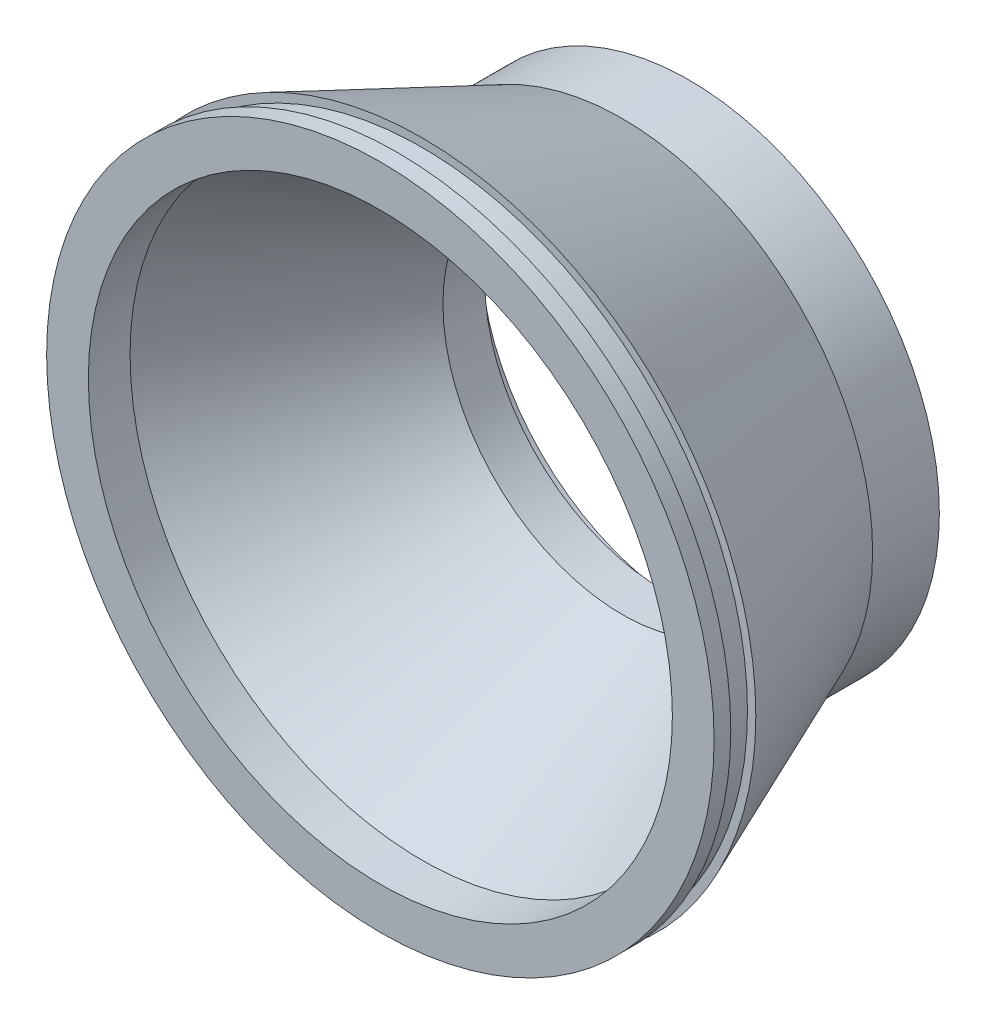
ISO-10303-21;
HEADER;
FILE_DESCRIPTION(('STEP AP214'),'2;1');
FILE_NAME('part.step','',(''),(''),'','','');
FILE_SCHEMA(('AUTOMOTIVE_DESIGN { 1 0 10303 214 1 1 1 1 }'));
ENDSEC;
DATA;
#1=APPLICATION_CONTEXT('core data for automotive mechanical design processes');
#2=APPLICATION_PROTOCOL_DEFINITION('international standard','automotive_design',2000,#1);
#3=PRODUCT_CONTEXT('',#1,'mechanical');
#4=PRODUCT('Part','Part','',(#3));
#5=PRODUCT_RELATED_PRODUCT_CATEGORY('part','',(#4));
#6=PRODUCT_DEFINITION_FORMATION('','',#4);
#7=PRODUCT_DEFINITION_CONTEXT('part definition',#1,'design');
#8=PRODUCT_DEFINITION('design','',#6,#7);
#9=PRODUCT_DEFINITION_SHAPE('','',#8);
#10=(LENGTH_UNIT() NAMED_UNIT(*) SI_UNIT(.MILLI.,.METRE.));
#11=(NAMED_UNIT(*) PLANE_ANGLE_UNIT() SI_UNIT($,.RADIAN.));
#12=(NAMED_UNIT(*) SI_UNIT($,.STERADIAN.) SOLID_ANGLE_UNIT());
#13=UNCERTAINTY_MEASURE_WITH_UNIT(LENGTH_MEASURE(1.E-05),#10,'distance_accuracy_value','');
#14=(GEOMETRIC_REPRESENTATION_CONTEXT(3) GLOBAL_UNCERTAINTY_ASSIGNED_CONTEXT((#13)) GLOBAL_UNIT_ASSIGNED_CONTEXT((#10,
#11,#12)) REPRESENTATION_CONTEXT('',''));
#15=CARTESIAN_POINT('',(0.,0.,0.));
#16=DIRECTION('',(0.,0.,1.));
#17=DIRECTION('',(1.,0.,0.));
#18=AXIS2_PLACEMENT_3D('',#15,#16,#17);
#19=CARTESIAN_POINT('',(0.,0.,3.));
#20=DIRECTION('',(0.,0.,-1.));
#21=DIRECTION('',(-1.,0.,0.));
#22=AXIS2_PLACEMENT_3D('',#19,#20,#21);
#23=CYLINDRICAL_SURFACE('',#22,25.);
#24=DIRECTION('',(0.,0.,-1.));
#25=VECTOR('',#24,1.);
#26=CARTESIAN_POINT('',(-21.6639868915005,-12.4768454332372,3.));
#27=LINE('',#26,#25);
#28=CARTESIAN_POINT('',(-21.6639868915005,-12.4768454332372,3.));
#29=VERTEX_POINT('',#28);
#30=CARTESIAN_POINT('',(-21.6639868915005,-12.4768454332372,0.5));
#31=VERTEX_POINT('',#30);
#32=EDGE_CURVE('E172',#29,#31,#27,.T.);
#33=ORIENTED_EDGE('',*,*,#32,.F.);
#34=CARTESIAN_POINT('',(0.,0.,3.));
#35=DIRECTION('',(0.,0.,-1.));
#36=DIRECTION('',(-1.,0.,0.));
#37=AXIS2_PLACEMENT_3D('',#34,#35,#36);
#38=CIRCLE('',#37,25.);
#39=CARTESIAN_POINT('',(-2.99459513123227,-24.82,3.));
#40=VERTEX_POINT('',#39);
#41=EDGE_CURVE('E183',#40,#29,#38,.T.);
#42=ORIENTED_EDGE('',*,*,#41,.F.);
#43=DIRECTION('',(0.,0.,-1.));
#44=VECTOR('',#43,1.);
#45=CARTESIAN_POINT('',(-2.99459513123227,-24.82,3.));
#46=LINE('',#45,#44);
#47=CARTESIAN_POINT('',(-2.99459513123227,-24.82,0.));
#48=VERTEX_POINT('',#47);
#49=EDGE_CURVE('E252',#40,#48,#46,.T.);
#50=ORIENTED_EDGE('',*,*,#49,.T.);
#51=CARTESIAN_POINT('',(0.,0.,0.));
#52=DIRECTION('',(0.,0.,-1.));
#53=DIRECTION('',(-1.,0.,0.));
#54=AXIS2_PLACEMENT_3D('',#51,#52,#53);
#55=CIRCLE('',#54,25.);
#56=CARTESIAN_POINT('',(-24.82,-2.99459513123227,0.));
#57=VERTEX_POINT('',#56);
#58=EDGE_CURVE('E203',#48,#57,#55,.T.);
#59=ORIENTED_EDGE('',*,*,#58,.T.);
#60=DIRECTION('',(0.,0.,-1.));
#61=VECTOR('',#60,1.);
#62=CARTESIAN_POINT('',(-24.82,-2.99459513123227,3.));
#63=LINE('',#62,#61);
#64=CARTESIAN_POINT('',(-24.82,-2.99459513123227,0.5));
#65=VERTEX_POINT('',#64);
#66=EDGE_CURVE('E249',#65,#57,#63,.T.);
#67=ORIENTED_EDGE('',*,*,#66,.F.);
#68=CARTESIAN_POINT('',(0.,0.,0.5));
#69=DIRECTION('',(0.,0.,1.));
#70=DIRECTION('',(-1.,0.,0.));
#71=AXIS2_PLACEMENT_3D('',#68,#69,#70);
#72=CIRCLE('',#71,25.);
#73=EDGE_CURVE('E185',#65,#31,#72,.T.);
#74=ORIENTED_EDGE('',*,*,#73,.T.);
#75=EDGE_LOOP('',(#33,#42,#50,#59,#67,#74));
#76=FACE_BOUND('',#75,.T.);
#77=ADVANCED_FACE('F34',(#76),#23,.F.);
#78=CARTESIAN_POINT('',(-25.,0.,3.));
#79=DIRECTION('',(0.,0.,-1.));
#80=DIRECTION('',(-1.,0.,0.));
#81=AXIS2_PLACEMENT_3D('',#78,#79,#80);
#82=CYLINDRICAL_SURFACE('',#81,3.);
#83=CARTESIAN_POINT('',(-25.,0.,0.5));
#84=DIRECTION('',(0.,0.,1.));
#85=DIRECTION('',(1.,0.,0.));
#86=AXIS2_PLACEMENT_3D('',#83,#84,#85);
#87=CIRCLE('',#86,3.);
#88=CARTESIAN_POINT('',(-28.,0.,0.5));
#89=VERTEX_POINT('',#88);
#90=EDGE_CURVE('E11',#65,#89,#87,.F.);
#91=ORIENTED_EDGE('',*,*,#90,.F.);
#92=ORIENTED_EDGE('',*,*,#66,.T.);
#93=CARTESIAN_POINT('',(-25.,0.,0.));
#94=DIRECTION('',(0.,0.,-1.));
#95=DIRECTION('',(-1.,0.,0.));
#96=AXIS2_PLACEMENT_3D('',#93,#94,#95);
#97=CIRCLE('',#96,3.);
#98=CARTESIAN_POINT('',(-24.82,2.99459513123227,0.));
#99=VERTEX_POINT('',#98);
#100=EDGE_CURVE('E250',#57,#99,#97,.T.);
#101=ORIENTED_EDGE('',*,*,#100,.T.);
#102=DIRECTION('',(0.,0.,-1.));
#103=VECTOR('',#102,1.);
#104=CARTESIAN_POINT('',(-24.82,2.99459513123227,3.));
#105=LINE('',#104,#103);
#106=CARTESIAN_POINT('',(-24.82,2.99459513123227,3.));
#107=VERTEX_POINT('',#106);
#108=EDGE_CURVE('E244',#107,#99,#105,.T.);
#109=ORIENTED_EDGE('',*,*,#108,.F.);
#110=CARTESIAN_POINT('',(-25.,0.,3.));
#111=DIRECTION('',(0.,0.,-1.));
#112=DIRECTION('',(-1.,0.,0.));
#113=AXIS2_PLACEMENT_3D('',#110,#111,#112);
#114=CIRCLE('',#113,3.);
#115=CARTESIAN_POINT('',(-28.,0.,3.));
#116=VERTEX_POINT('',#115);
#117=EDGE_CURVE('E247',#116,#107,#114,.T.);
#118=ORIENTED_EDGE('',*,*,#117,.F.);
#119=DIRECTION('',(0.,0.,1.));
#120=VECTOR('',#119,1.);
#121=CARTESIAN_POINT('',(-28.,0.,3.));
#122=LINE('',#121,#120);
#123=EDGE_CURVE('E186',#89,#116,#122,.T.);
#124=ORIENTED_EDGE('',*,*,#123,.F.);
#125=EDGE_LOOP('',(#91,#92,#101,#109,#118,#124));
#126=FACE_BOUND('',#125,.T.);
#127=ADVANCED_FACE('F345',(#126),#82,.F.);
#128=CARTESIAN_POINT('',(0.,-25.,3.));
#129=DIRECTION('',(0.,0.,-1.));
#130=DIRECTION('',(-1.,0.,0.));
#131=AXIS2_PLACEMENT_3D('',#128,#129,#130);
#132=CYLINDRICAL_SURFACE('',#131,3.);
#133=DIRECTION('',(0.,0.,-1.));
#134=VECTOR('',#133,1.);
#135=CARTESIAN_POINT('',(0.,-28.,3.));
#136=LINE('',#135,#134);
#137=CARTESIAN_POINT('',(0.,-28.,3.));
#138=VERTEX_POINT('',#137);
#139=CARTESIAN_POINT('',(0.,-28.,0.5));
#140=VERTEX_POINT('',#139);
#141=EDGE_CURVE('E177',#138,#140,#136,.T.);
#142=ORIENTED_EDGE('',*,*,#141,.T.);
#143=CARTESIAN_POINT('',(0.,-25.,0.5));
#144=DIRECTION('',(0.,0.,-1.));
#145=DIRECTION('',(-1.,0.,0.));
#146=AXIS2_PLACEMENT_3D('',#143,#144,#145);
#147=CIRCLE('',#146,3.);
#148=CARTESIAN_POINT('',(2.99459513123227,-24.82,0.5));
#149=VERTEX_POINT('',#148);
#150=EDGE_CURVE('E42',#140,#149,#147,.F.);
#151=ORIENTED_EDGE('',*,*,#150,.T.);
#152=DIRECTION('',(0.,0.,-1.));
#153=VECTOR('',#152,1.);
#154=CARTESIAN_POINT('',(2.99459513123227,-24.82,3.));
#155=LINE('',#154,#153);
#156=CARTESIAN_POINT('',(2.99459513123227,-24.82,0.));
#157=VERTEX_POINT('',#156);
#158=EDGE_CURVE('E257',#149,#157,#155,.T.);
#159=ORIENTED_EDGE('',*,*,#158,.T.);
#160=CARTESIAN_POINT('',(0.,-25.,0.));
#161=DIRECTION('',(0.,0.,-1.));
#162=DIRECTION('',(-1.,0.,0.));
#163=AXIS2_PLACEMENT_3D('',#160,#161,#162);
#164=CIRCLE('',#163,3.);
#165=EDGE_CURVE('E258',#157,#48,#164,.T.);
#166=ORIENTED_EDGE('',*,*,#165,.T.);
#167=ORIENTED_EDGE('',*,*,#49,.F.);
#168=CARTESIAN_POINT('',(0.,-25.,3.));
#169=DIRECTION('',(0.,0.,-1.));
#170=DIRECTION('',(-1.,0.,0.));
#171=AXIS2_PLACEMENT_3D('',#168,#169,#170);
#172=CIRCLE('',#171,3.);
#173=EDGE_CURVE('E192',#138,#40,#172,.T.);
#174=ORIENTED_EDGE('',*,*,#173,.F.);
#175=EDGE_LOOP('',(#142,#151,#159,#166,#167,#174));
#176=FACE_BOUND('',#175,.T.);
#177=ADVANCED_FACE('F299',(#176),#132,.F.);
#178=CARTESIAN_POINT('',(0.,25.,3.));
#179=DIRECTION('',(0.,0.,-1.));
#180=DIRECTION('',(-1.,0.,0.));
#181=AXIS2_PLACEMENT_3D('',#178,#179,#180);
#182=CYLINDRICAL_SURFACE('',#181,3.);
#183=DIRECTION('',(0.,0.,-1.));
#184=VECTOR('',#183,1.);
#185=CARTESIAN_POINT('',(0.,28.,3.));
#186=LINE('',#185,#184);
#187=CARTESIAN_POINT('',(0.,28.,3.));
#188=VERTEX_POINT('',#187);
#189=CARTESIAN_POINT('',(0.,28.,0.5));
#190=VERTEX_POINT('',#189);
#191=EDGE_CURVE('E382',#188,#190,#186,.T.);
#192=ORIENTED_EDGE('',*,*,#191,.T.);
#193=CARTESIAN_POINT('',(0.,25.,0.5));
#194=DIRECTION('',(0.,0.,-1.));
#195=DIRECTION('',(-1.,0.,0.));
#196=AXIS2_PLACEMENT_3D('',#193,#194,#195);
#197=CIRCLE('',#196,3.);
#198=CARTESIAN_POINT('',(-2.99459513123227,24.82,0.5));
#199=VERTEX_POINT('',#198);
#200=EDGE_CURVE('E294',#190,#199,#197,.F.);
#201=ORIENTED_EDGE('',*,*,#200,.T.);
#202=DIRECTION('',(0.,0.,-1.));
#203=VECTOR('',#202,1.);
#204=CARTESIAN_POINT('',(-2.99459513123227,24.82,3.));
#205=LINE('',#204,#203);
#206=CARTESIAN_POINT('',(-2.99459513123227,24.82,0.));
#207=VERTEX_POINT('',#206);
#208=EDGE_CURVE('E241',#199,#207,#205,.T.);
#209=ORIENTED_EDGE('',*,*,#208,.T.);
#210=CARTESIAN_POINT('',(0.,25.,0.));
#211=DIRECTION('',(0.,0.,-1.));
#212=DIRECTION('',(-1.,0.,0.));
#213=AXIS2_PLACEMENT_3D('',#210,#211,#212);
#214=CIRCLE('',#213,3.);
#215=CARTESIAN_POINT('',(2.99459513123227,24.82,0.));
#216=VERTEX_POINT('',#215);
#217=EDGE_CURVE('E242',#207,#216,#214,.T.);
#218=ORIENTED_EDGE('',*,*,#217,.T.);
#219=DIRECTION('',(0.,0.,-1.));
#220=VECTOR('',#219,1.);
#221=CARTESIAN_POINT('',(2.99459513123227,24.82,3.));
#222=LINE('',#221,#220);
#223=CARTESIAN_POINT('',(2.99459513123227,24.82,3.));
#224=VERTEX_POINT('',#223);
#225=EDGE_CURVE('E224',#224,#216,#222,.T.);
#226=ORIENTED_EDGE('',*,*,#225,.F.);
#227=CARTESIAN_POINT('',(0.,25.,3.));
#228=DIRECTION('',(0.,0.,-1.));
#229=DIRECTION('',(-1.,0.,0.));
#230=AXIS2_PLACEMENT_3D('',#227,#228,#229);
#231=CIRCLE('',#230,3.);
#232=EDGE_CURVE('E217',#188,#224,#231,.T.);
#233=ORIENTED_EDGE('',*,*,#232,.F.);
#234=EDGE_LOOP('',(#192,#201,#209,#218,#226,#233));
#235=FACE_BOUND('',#234,.T.);
#236=ADVANCED_FACE('F355',(#235),#182,.F.);
#237=DIRECTION('',(0.,0.,1.));
#238=VECTOR('',#237,1.);
#239=CARTESIAN_POINT('',(21.6561516909664,12.490440101848,3.));
#240=LINE('',#239,#238);
#241=CARTESIAN_POINT('',(21.6561516909664,12.490440101848,0.5));
#242=VERTEX_POINT('',#241);
#243=CARTESIAN_POINT('',(21.6561516909664,12.490440101848,3.));
#244=VERTEX_POINT('',#243);
#245=EDGE_CURVE('E228',#242,#244,#240,.T.);
#246=ORIENTED_EDGE('',*,*,#245,.T.);
#247=EDGE_CURVE('E199',#224,#244,#38,.T.);
#248=ORIENTED_EDGE('',*,*,#247,.F.);
#249=ORIENTED_EDGE('',*,*,#225,.T.);
#250=CARTESIAN_POINT('',(24.82,2.99459513123226,0.));
#251=VERTEX_POINT('',#250);
#252=EDGE_CURVE('E201',#216,#251,#55,.T.);
#253=ORIENTED_EDGE('',*,*,#252,.T.);
#254=DIRECTION('',(0.,0.,-1.));
#255=VECTOR('',#254,1.);
#256=CARTESIAN_POINT('',(24.82,2.99459513123226,3.));
#257=LINE('',#256,#255);
#258=CARTESIAN_POINT('',(24.82,2.99459513123227,0.5));
#259=VERTEX_POINT('',#258);
#260=EDGE_CURVE('E265',#259,#251,#257,.T.);
#261=ORIENTED_EDGE('',*,*,#260,.F.);
#262=CARTESIAN_POINT('',(0.,0.,0.5));
#263=DIRECTION('',(0.,0.,1.));
#264=DIRECTION('',(1.,0.,0.));
#265=AXIS2_PLACEMENT_3D('',#262,#263,#264);
#266=CIRCLE('',#265,25.);
#267=EDGE_CURVE('E230',#259,#242,#266,.T.);
#268=ORIENTED_EDGE('',*,*,#267,.T.);
#269=EDGE_LOOP('',(#246,#248,#249,#253,#261,#268));
#270=FACE_BOUND('',#269,.T.);
#271=ADVANCED_FACE('F222',(#270),#23,.F.);
#272=CARTESIAN_POINT('',(25.,0.,3.));
#273=DIRECTION('',(0.,0.,-1.));
#274=DIRECTION('',(-1.,0.,0.));
#275=AXIS2_PLACEMENT_3D('',#272,#273,#274);
#276=CYLINDRICAL_SURFACE('',#275,3.);
#277=DIRECTION('',(0.,0.,-1.));
#278=VECTOR('',#277,1.);
#279=CARTESIAN_POINT('',(28.,0.,3.));
#280=LINE('',#279,#278);
#281=CARTESIAN_POINT('',(28.,0.,3.));
#282=VERTEX_POINT('',#281);
#283=CARTESIAN_POINT('',(28.,0.,0.5));
#284=VERTEX_POINT('',#283);
#285=EDGE_CURVE('E308',#282,#284,#280,.T.);
#286=ORIENTED_EDGE('',*,*,#285,.T.);
#287=CARTESIAN_POINT('',(25.,0.,0.5));
#288=DIRECTION('',(0.,0.,-1.));
#289=DIRECTION('',(-1.,0.,0.));
#290=AXIS2_PLACEMENT_3D('',#287,#288,#289);
#291=CIRCLE('',#290,3.);
#292=EDGE_CURVE('E274',#284,#259,#291,.F.);
#293=ORIENTED_EDGE('',*,*,#292,.T.);
#294=ORIENTED_EDGE('',*,*,#260,.T.);
#295=CARTESIAN_POINT('',(25.,0.,0.));
#296=DIRECTION('',(0.,0.,-1.));
#297=DIRECTION('',(-1.,0.,0.));
#298=AXIS2_PLACEMENT_3D('',#295,#296,#297);
#299=CIRCLE('',#298,3.);
#300=CARTESIAN_POINT('',(24.82,-2.99459513123227,0.));
#301=VERTEX_POINT('',#300);
#302=EDGE_CURVE('E234',#251,#301,#299,.T.);
#303=ORIENTED_EDGE('',*,*,#302,.T.);
#304=DIRECTION('',(0.,0.,-1.));
#305=VECTOR('',#304,1.);
#306=CARTESIAN_POINT('',(24.82,-2.99459513123227,3.));
#307=LINE('',#306,#305);
#308=CARTESIAN_POINT('',(24.82,-2.99459513123227,3.));
#309=VERTEX_POINT('',#308);
#310=EDGE_CURVE('E260',#309,#301,#307,.T.);
#311=ORIENTED_EDGE('',*,*,#310,.F.);
#312=CARTESIAN_POINT('',(25.,0.,3.));
#313=DIRECTION('',(0.,0.,-1.));
#314=DIRECTION('',(-1.,0.,0.));
#315=AXIS2_PLACEMENT_3D('',#312,#313,#314);
#316=CIRCLE('',#315,3.);
#317=EDGE_CURVE('E263',#282,#309,#316,.T.);
#318=ORIENTED_EDGE('',*,*,#317,.F.);
#319=EDGE_LOOP('',(#286,#293,#294,#303,#311,#318));
#320=FACE_BOUND('',#319,.T.);
#321=ADVANCED_FACE('F272',(#320),#276,.F.);
#322=CARTESIAN_POINT('',(0.,0.,0.5));
#323=DIRECTION('',(0.,0.,1.));
#324=DIRECTION('',(0.,1.,0.));
#325=AXIS2_PLACEMENT_3D('',#322,#323,#324);
#326=CIRCLE('',#325,25.);
#327=CARTESIAN_POINT('',(-12.8016913293476,21.4736279912852,0.5));
#328=VERTEX_POINT('',#327);
#329=EDGE_CURVE('E321',#199,#328,#326,.T.);
#330=ORIENTED_EDGE('',*,*,#329,.T.);
#331=DIRECTION('',(0.,0.,1.));
#332=VECTOR('',#331,1.);
#333=CARTESIAN_POINT('',(-12.8016913293476,21.4736279912852,3.));
#334=LINE('',#333,#332);
#335=CARTESIAN_POINT('',(-12.8016913293476,21.4736279912852,3.));
#336=VERTEX_POINT('',#335);
#337=EDGE_CURVE('E318',#328,#336,#334,.T.);
#338=ORIENTED_EDGE('',*,*,#337,.T.);
#339=EDGE_CURVE('E197',#107,#336,#38,.T.);
#340=ORIENTED_EDGE('',*,*,#339,.F.);
#341=ORIENTED_EDGE('',*,*,#108,.T.);
#342=EDGE_CURVE('E195',#99,#207,#55,.T.);
#343=ORIENTED_EDGE('',*,*,#342,.T.);
#344=ORIENTED_EDGE('',*,*,#208,.F.);
#345=EDGE_LOOP('',(#330,#338,#340,#341,#343,#344));
#346=FACE_BOUND('',#345,.T.);
#347=ADVANCED_FACE('F356',(#346),#23,.F.);
#348=CARTESIAN_POINT('',(0.,0.,8.));
#349=DIRECTION('',(0.,0.,-1.));
#350=DIRECTION('',(-1.,0.,0.));
#351=AXIS2_PLACEMENT_3D('',#348,#349,#350);
#352=CYLINDRICAL_SURFACE('',#351,21.5);
#353=CARTESIAN_POINT('',(0.,0.,8.));
#354=DIRECTION('',(0.,0.,-1.));
#355=DIRECTION('',(-1.,0.,0.));
#356=AXIS2_PLACEMENT_3D('',#353,#354,#355);
#357=CIRCLE('',#356,21.5);
#358=CARTESIAN_POINT('',(-21.5,0.,8.));
#359=VERTEX_POINT('',#358);
#360=EDGE_CURVE('E209',#359,#359,#357,.T.);
#361=ORIENTED_EDGE('',*,*,#360,.F.);
#362=EDGE_LOOP('',(#361));
#363=FACE_BOUND('',#362,.T.);
#364=CARTESIAN_POINT('',(0.,0.,3.));
#365=DIRECTION('',(0.,0.,-1.));
#366=DIRECTION('',(-1.,0.,0.));
#367=AXIS2_PLACEMENT_3D('',#364,#365,#366);
#368=CIRCLE('',#367,21.5);
#369=CARTESIAN_POINT('',(-21.5,0.,3.));
#370=VERTEX_POINT('',#369);
#371=EDGE_CURVE('E206',#370,#370,#368,.F.);
#372=ORIENTED_EDGE('',*,*,#371,.F.);
#373=EDGE_LOOP('',(#372));
#374=FACE_BOUND('',#373,.T.);
#375=ADVANCED_FACE('F362',(#363,#374),#352,.F.);
#376=CARTESIAN_POINT('',(0.,0.,8.));
#377=DIRECTION('',(0.,0.,-1.));
#378=DIRECTION('',(-1.,0.,0.));
#379=AXIS2_PLACEMENT_3D('',#376,#377,#378);
#380=CYLINDRICAL_SURFACE('',#379,30.);
#381=CARTESIAN_POINT('',(0.,0.,8.));
#382=DIRECTION('',(0.,0.,1.));
#383=DIRECTION('',(1.,0.,0.));
#384=AXIS2_PLACEMENT_3D('',#381,#382,#383);
#385=CIRCLE('',#384,30.);
#386=CARTESIAN_POINT('',(30.,0.,8.));
#387=VERTEX_POINT('',#386);
#388=EDGE_CURVE('E288',#387,#387,#385,.T.);
#389=ORIENTED_EDGE('',*,*,#388,.F.);
#390=EDGE_LOOP('',(#389));
#391=FACE_BOUND('',#390,.T.);
#392=CARTESIAN_POINT('',(0.,0.,0.));
#393=DIRECTION('',(0.,0.,1.));
#394=DIRECTION('',(1.,0.,0.));
#395=AXIS2_PLACEMENT_3D('',#392,#393,#394);
#396=CIRCLE('',#395,30.);
#397=CARTESIAN_POINT('',(30.,0.,0.));
#398=VERTEX_POINT('',#397);
#399=EDGE_CURVE('E287',#398,#398,#396,.T.);
#400=ORIENTED_EDGE('',*,*,#399,.T.);
#401=EDGE_LOOP('',(#400));
#402=FACE_BOUND('',#401,.T.);
#403=ADVANCED_FACE('F36',(#391,#402),#380,.T.);
#404=CARTESIAN_POINT('',(0.,0.,0.));
#405=DIRECTION('',(0.,0.,1.));
#406=DIRECTION('',(1.,0.,0.));
#407=AXIS2_PLACEMENT_3D('',#404,#405,#406);
#408=PLANE('',#407);
#409=ORIENTED_EDGE('',*,*,#252,.F.);
#410=ORIENTED_EDGE('',*,*,#217,.F.);
#411=ORIENTED_EDGE('',*,*,#342,.F.);
#412=ORIENTED_EDGE('',*,*,#100,.F.);
#413=ORIENTED_EDGE('',*,*,#58,.F.);
#414=ORIENTED_EDGE('',*,*,#165,.F.);
#415=EDGE_CURVE('E282',#301,#157,#55,.T.);
#416=ORIENTED_EDGE('',*,*,#415,.F.);
#417=ORIENTED_EDGE('',*,*,#302,.F.);
#418=EDGE_LOOP('',(#409,#410,#411,#412,#413,#414,#416,#417));
#419=FACE_BOUND('',#418,.T.);
#420=ORIENTED_EDGE('',*,*,#399,.F.);
#421=EDGE_LOOP('',(#420));
#422=FACE_BOUND('',#421,.T.);
#423=ADVANCED_FACE('F277',(#419,#422),#408,.F.);
#424=CARTESIAN_POINT('',(0.,0.,3.));
#425=DIRECTION('',(0.,0.,-1.));
#426=DIRECTION('',(-1.,0.,0.));
#427=AXIS2_PLACEMENT_3D('',#424,#425,#426);
#428=PLANE('',#427);
#429=ORIENTED_EDGE('',*,*,#41,.T.);
#430=DIRECTION('',(0.866559475660022,0.499073817329489,0.));
#431=VECTOR('',#430,1.);
#432=CARTESIAN_POINT('',(-21.6639868915005,-12.4768454332372,3.));
#433=LINE('',#432,#431);
#434=CARTESIAN_POINT('',(-24.2636653184806,-13.9740668852257,3.));
#435=VERTEX_POINT('',#434);
#436=EDGE_CURVE('E169',#435,#29,#433,.T.);
#437=ORIENTED_EDGE('',*,*,#436,.F.);
#438=CARTESIAN_POINT('',(0.,0.,3.));
#439=DIRECTION('',(0.,0.,1.));
#440=DIRECTION('',(-1.,0.,0.));
#441=AXIS2_PLACEMENT_3D('',#438,#439,#440);
#442=CIRCLE('',#441,28.);
#443=EDGE_CURVE('E49',#116,#435,#442,.T.);
#444=ORIENTED_EDGE('',*,*,#443,.F.);
#445=ORIENTED_EDGE('',*,*,#117,.T.);
#446=ORIENTED_EDGE('',*,*,#339,.T.);
#447=DIRECTION('',(-0.512067653173904,0.858945119651407,0.));
#448=VECTOR('',#447,1.);
#449=CARTESIAN_POINT('',(-12.8016913293476,21.4736279912852,3.));
#450=LINE('',#449,#448);
#451=CARTESIAN_POINT('',(-14.3378942888693,24.0504633502394,3.));
#452=VERTEX_POINT('',#451);
#453=EDGE_CURVE('E385',#336,#452,#450,.T.);
#454=ORIENTED_EDGE('',*,*,#453,.T.);
#455=CARTESIAN_POINT('',(0.,0.,3.));
#456=DIRECTION('',(0.,0.,1.));
#457=DIRECTION('',(0.,1.,0.));
#458=AXIS2_PLACEMENT_3D('',#455,#456,#457);
#459=CIRCLE('',#458,28.);
#460=EDGE_CURVE('E381',#188,#452,#459,.T.);
#461=ORIENTED_EDGE('',*,*,#460,.F.);
#462=ORIENTED_EDGE('',*,*,#232,.T.);
#463=ORIENTED_EDGE('',*,*,#247,.T.);
#464=DIRECTION('',(0.866246067638656,0.49961760407392,0.));
#465=VECTOR('',#464,1.);
#466=CARTESIAN_POINT('',(21.6561516909664,12.490440101848,3.));
#467=LINE('',#466,#465);
#468=CARTESIAN_POINT('',(24.2548898938824,13.9892929140698,3.));
#469=VERTEX_POINT('',#468);
#470=EDGE_CURVE('E213',#244,#469,#467,.T.);
#471=ORIENTED_EDGE('',*,*,#470,.T.);
#472=CARTESIAN_POINT('',(0.,0.,3.));
#473=DIRECTION('',(0.,0.,1.));
#474=DIRECTION('',(1.,0.,0.));
#475=AXIS2_PLACEMENT_3D('',#472,#473,#474);
#476=CIRCLE('',#475,28.);
#477=EDGE_CURVE('E310',#282,#469,#476,.T.);
#478=ORIENTED_EDGE('',*,*,#477,.F.);
#479=ORIENTED_EDGE('',*,*,#317,.T.);
#480=CARTESIAN_POINT('',(12.8016913293476,-21.4736279912852,3.));
#481=VERTEX_POINT('',#480);
#482=EDGE_CURVE('E194',#309,#481,#38,.T.);
#483=ORIENTED_EDGE('',*,*,#482,.T.);
#484=DIRECTION('',(0.512067653173905,-0.858945119651407,0.));
#485=VECTOR('',#484,1.);
#486=CARTESIAN_POINT('',(12.8016913293476,-21.4736279912852,3.));
#487=LINE('',#486,#485);
#488=CARTESIAN_POINT('',(14.3378942888693,-24.0504633502394,3.));
#489=VERTEX_POINT('',#488);
#490=EDGE_CURVE('E400',#481,#489,#487,.T.);
#491=ORIENTED_EDGE('',*,*,#490,.T.);
#492=CARTESIAN_POINT('',(0.,0.,3.));
#493=DIRECTION('',(0.,0.,1.));
#494=DIRECTION('',(0.,-1.,0.));
#495=AXIS2_PLACEMENT_3D('',#492,#493,#494);
#496=CIRCLE('',#495,28.);
#497=EDGE_CURVE('E398',#138,#489,#496,.T.);
#498=ORIENTED_EDGE('',*,*,#497,.F.);
#499=ORIENTED_EDGE('',*,*,#173,.T.);
#500=EDGE_LOOP('',(#429,#437,#444,#445,#446,#454,#461,#462,#463,#471,#478,#479,#483,#491,#498,#499));
#501=FACE_BOUND('',#500,.T.);
#502=ORIENTED_EDGE('',*,*,#371,.T.);
#503=EDGE_LOOP('',(#502));
#504=FACE_BOUND('',#503,.T.);
#505=ADVANCED_FACE('F188',(#501,#504),#428,.T.);
#506=CARTESIAN_POINT('',(0.,0.,0.5));
#507=DIRECTION('',(0.,0.,1.));
#508=DIRECTION('',(0.,-1.,0.));
#509=AXIS2_PLACEMENT_3D('',#506,#507,#508);
#510=CIRCLE('',#509,25.);
#511=CARTESIAN_POINT('',(12.8016913293476,-21.4736279912852,0.5));
#512=VERTEX_POINT('',#511);
#513=EDGE_CURVE('E57',#149,#512,#510,.T.);
#514=ORIENTED_EDGE('',*,*,#513,.T.);
#515=DIRECTION('',(0.,0.,1.));
#516=VECTOR('',#515,1.);
#517=CARTESIAN_POINT('',(12.8016913293476,-21.4736279912852,3.));
#518=LINE('',#517,#516);
#519=EDGE_CURVE('E386',#512,#481,#518,.T.);
#520=ORIENTED_EDGE('',*,*,#519,.T.);
#521=ORIENTED_EDGE('',*,*,#482,.F.);
#522=ORIENTED_EDGE('',*,*,#310,.T.);
#523=ORIENTED_EDGE('',*,*,#415,.T.);
#524=ORIENTED_EDGE('',*,*,#158,.F.);
#525=EDGE_LOOP('',(#514,#520,#521,#522,#523,#524));
#526=FACE_BOUND('',#525,.T.);
#527=ADVANCED_FACE('F303',(#526),#23,.F.);
#528=CARTESIAN_POINT('',(25.,0.,0.5));
#529=DIRECTION('',(0.,0.,-1.));
#530=DIRECTION('',(-1.,0.,0.));
#531=AXIS2_PLACEMENT_3D('',#528,#529,#530);
#532=PLANE('',#531);
#533=CARTESIAN_POINT('',(0.,0.,0.5));
#534=DIRECTION('',(0.,0.,1.));
#535=DIRECTION('',(1.,0.,0.));
#536=AXIS2_PLACEMENT_3D('',#533,#534,#535);
#537=CIRCLE('',#536,28.);
#538=CARTESIAN_POINT('',(24.2548898938824,13.9892929140698,0.5));
#539=VERTEX_POINT('',#538);
#540=EDGE_CURVE('E317',#284,#539,#537,.T.);
#541=ORIENTED_EDGE('',*,*,#540,.T.);
#542=DIRECTION('',(-0.866246067638656,-0.49961760407392,0.));
#543=VECTOR('',#542,1.);
#544=CARTESIAN_POINT('',(21.6561516909664,12.490440101848,0.5));
#545=LINE('',#544,#543);
#546=EDGE_CURVE('E236',#539,#242,#545,.T.);
#547=ORIENTED_EDGE('',*,*,#546,.T.);
#548=ORIENTED_EDGE('',*,*,#267,.F.);
#549=ORIENTED_EDGE('',*,*,#292,.F.);
#550=EDGE_LOOP('',(#541,#547,#548,#549));
#551=FACE_BOUND('',#550,.T.);
#552=ADVANCED_FACE('F327',(#551),#532,.F.);
#553=CARTESIAN_POINT('',(0.,0.,0.));
#554=DIRECTION('',(0.49961760407392,-0.866246067638656,0.));
#555=DIRECTION('',(0.,0.,-1.));
#556=AXIS2_PLACEMENT_3D('',#553,#554,#555);
#557=PLANE('',#556);
#558=ORIENTED_EDGE('',*,*,#245,.F.);
#559=ORIENTED_EDGE('',*,*,#546,.F.);
#560=DIRECTION('',(0.,0.,-1.));
#561=VECTOR('',#560,1.);
#562=CARTESIAN_POINT('',(24.2548898938824,13.9892929140698,3.));
#563=LINE('',#562,#561);
#564=EDGE_CURVE('E312',#469,#539,#563,.T.);
#565=ORIENTED_EDGE('',*,*,#564,.F.);
#566=ORIENTED_EDGE('',*,*,#470,.F.);
#567=EDGE_LOOP('',(#558,#559,#565,#566));
#568=FACE_BOUND('',#567,.T.);
#569=ADVANCED_FACE('F328',(#568),#557,.T.);
#570=CARTESIAN_POINT('',(0.,0.,3.));
#571=DIRECTION('',(0.,0.,1.));
#572=DIRECTION('',(1.,0.,0.));
#573=AXIS2_PLACEMENT_3D('',#570,#571,#572);
#574=CYLINDRICAL_SURFACE('',#573,28.);
#575=ORIENTED_EDGE('',*,*,#540,.F.);
#576=ORIENTED_EDGE('',*,*,#285,.F.);
#577=ORIENTED_EDGE('',*,*,#477,.T.);
#578=ORIENTED_EDGE('',*,*,#564,.T.);
#579=EDGE_LOOP('',(#575,#576,#577,#578));
#580=FACE_BOUND('',#579,.T.);
#581=ADVANCED_FACE('F315',(#580),#574,.F.);
#582=CARTESIAN_POINT('',(0.,25.,0.5));
#583=DIRECTION('',(0.,0.,-1.));
#584=DIRECTION('',(-1.,0.,0.));
#585=AXIS2_PLACEMENT_3D('',#582,#583,#584);
#586=PLANE('',#585);
#587=CARTESIAN_POINT('',(0.,0.,0.5));
#588=DIRECTION('',(0.,0.,1.));
#589=DIRECTION('',(0.,1.,0.));
#590=AXIS2_PLACEMENT_3D('',#587,#588,#589);
#591=CIRCLE('',#590,28.);
#592=CARTESIAN_POINT('',(-14.3378942888693,24.0504633502394,0.5));
#593=VERTEX_POINT('',#592);
#594=EDGE_CURVE('E374',#190,#593,#591,.T.);
#595=ORIENTED_EDGE('',*,*,#594,.T.);
#596=DIRECTION('',(0.512067653173904,-0.858945119651407,0.));
#597=VECTOR('',#596,1.);
#598=CARTESIAN_POINT('',(-12.8016913293476,21.4736279912852,0.5));
#599=LINE('',#598,#597);
#600=EDGE_CURVE('E373',#593,#328,#599,.T.);
#601=ORIENTED_EDGE('',*,*,#600,.T.);
#602=ORIENTED_EDGE('',*,*,#329,.F.);
#603=ORIENTED_EDGE('',*,*,#200,.F.);
#604=EDGE_LOOP('',(#595,#601,#602,#603));
#605=FACE_BOUND('',#604,.T.);
#606=ADVANCED_FACE('F331',(#605),#586,.F.);
#607=CARTESIAN_POINT('',(0.,0.,0.));
#608=DIRECTION('',(-0.858945119651407,-0.512067653173904,0.));
#609=DIRECTION('',(0.512067653173904,-0.858945119651407,0.));
#610=AXIS2_PLACEMENT_3D('',#607,#608,#609);
#611=PLANE('',#610);
#612=ORIENTED_EDGE('',*,*,#453,.F.);
#613=ORIENTED_EDGE('',*,*,#337,.F.);
#614=ORIENTED_EDGE('',*,*,#600,.F.);
#615=DIRECTION('',(0.,0.,-1.));
#616=VECTOR('',#615,1.);
#617=CARTESIAN_POINT('',(-14.3378942888693,24.0504633502394,3.));
#618=LINE('',#617,#616);
#619=EDGE_CURVE('E379',#452,#593,#618,.T.);
#620=ORIENTED_EDGE('',*,*,#619,.F.);
#621=EDGE_LOOP('',(#612,#613,#614,#620));
#622=FACE_BOUND('',#621,.T.);
#623=ADVANCED_FACE('F340',(#622),#611,.F.);
#624=CARTESIAN_POINT('',(0.,0.,3.));
#625=DIRECTION('',(0.,0.,1.));
#626=DIRECTION('',(1.,0.,0.));
#627=AXIS2_PLACEMENT_3D('',#624,#625,#626);
#628=CYLINDRICAL_SURFACE('',#627,28.);
#629=ORIENTED_EDGE('',*,*,#594,.F.);
#630=ORIENTED_EDGE('',*,*,#191,.F.);
#631=ORIENTED_EDGE('',*,*,#460,.T.);
#632=ORIENTED_EDGE('',*,*,#619,.T.);
#633=EDGE_LOOP('',(#629,#630,#631,#632));
#634=FACE_BOUND('',#633,.T.);
#635=ADVANCED_FACE('F343',(#634),#628,.F.);
#636=CARTESIAN_POINT('',(0.,-25.,0.5));
#637=DIRECTION('',(0.,0.,-1.));
#638=DIRECTION('',(-1.,0.,0.));
#639=AXIS2_PLACEMENT_3D('',#636,#637,#638);
#640=PLANE('',#639);
#641=CARTESIAN_POINT('',(0.,0.,0.5));
#642=DIRECTION('',(0.,0.,1.));
#643=DIRECTION('',(0.,-1.,0.));
#644=AXIS2_PLACEMENT_3D('',#641,#642,#643);
#645=CIRCLE('',#644,28.);
#646=CARTESIAN_POINT('',(14.3378942888693,-24.0504633502394,0.5));
#647=VERTEX_POINT('',#646);
#648=EDGE_CURVE('E394',#140,#647,#645,.T.);
#649=ORIENTED_EDGE('',*,*,#648,.T.);
#650=DIRECTION('',(-0.512067653173905,0.858945119651407,0.));
#651=VECTOR('',#650,1.);
#652=CARTESIAN_POINT('',(12.8016913293476,-21.4736279912852,0.5));
#653=LINE('',#652,#651);
#654=EDGE_CURVE('E392',#647,#512,#653,.T.);
#655=ORIENTED_EDGE('',*,*,#654,.T.);
#656=ORIENTED_EDGE('',*,*,#513,.F.);
#657=ORIENTED_EDGE('',*,*,#150,.F.);
#658=EDGE_LOOP('',(#649,#655,#656,#657));
#659=FACE_BOUND('',#658,.T.);
#660=ADVANCED_FACE('F486',(#659),#640,.F.);
#661=CARTESIAN_POINT('',(0.,0.,0.));
#662=DIRECTION('',(0.858945119651407,0.512067653173905,0.));
#663=DIRECTION('',(-0.512067653173905,0.858945119651407,0.));
#664=AXIS2_PLACEMENT_3D('',#661,#662,#663);
#665=PLANE('',#664);
#666=ORIENTED_EDGE('',*,*,#490,.F.);
#667=ORIENTED_EDGE('',*,*,#519,.F.);
#668=ORIENTED_EDGE('',*,*,#654,.F.);
#669=DIRECTION('',(0.,0.,-1.));
#670=VECTOR('',#669,1.);
#671=CARTESIAN_POINT('',(14.3378942888693,-24.0504633502394,3.));
#672=LINE('',#671,#670);
#673=EDGE_CURVE('E396',#489,#647,#672,.T.);
#674=ORIENTED_EDGE('',*,*,#673,.F.);
#675=EDGE_LOOP('',(#666,#667,#668,#674));
#676=FACE_BOUND('',#675,.T.);
#677=ADVANCED_FACE('F477',(#676),#665,.F.);
#678=CARTESIAN_POINT('',(0.,0.,3.));
#679=DIRECTION('',(0.,0.,1.));
#680=DIRECTION('',(1.,0.,0.));
#681=AXIS2_PLACEMENT_3D('',#678,#679,#680);
#682=CYLINDRICAL_SURFACE('',#681,28.);
#683=ORIENTED_EDGE('',*,*,#648,.F.);
#684=ORIENTED_EDGE('',*,*,#141,.F.);
#685=ORIENTED_EDGE('',*,*,#497,.T.);
#686=ORIENTED_EDGE('',*,*,#673,.T.);
#687=EDGE_LOOP('',(#683,#684,#685,#686));
#688=FACE_BOUND('',#687,.T.);
#689=ADVANCED_FACE('F475',(#688),#682,.F.);
#690=CARTESIAN_POINT('',(-25.,0.,0.5));
#691=DIRECTION('',(0.,0.,1.));
#692=DIRECTION('',(1.,0.,0.));
#693=AXIS2_PLACEMENT_3D('',#690,#691,#692);
#694=PLANE('',#693);
#695=ORIENTED_EDGE('',*,*,#90,.T.);
#696=CARTESIAN_POINT('',(0.,0.,0.5));
#697=DIRECTION('',(0.,0.,1.));
#698=DIRECTION('',(-1.,0.,0.));
#699=AXIS2_PLACEMENT_3D('',#696,#697,#698);
#700=CIRCLE('',#699,28.);
#701=CARTESIAN_POINT('',(-24.2636653184806,-13.9740668852257,0.5));
#702=VERTEX_POINT('',#701);
#703=EDGE_CURVE('E406',#89,#702,#700,.T.);
#704=ORIENTED_EDGE('',*,*,#703,.T.);
#705=DIRECTION('',(-0.866559475660022,-0.499073817329489,0.));
#706=VECTOR('',#705,1.);
#707=CARTESIAN_POINT('',(-21.6639868915005,-12.4768454332372,0.5));
#708=LINE('',#707,#706);
#709=EDGE_CURVE('E411',#31,#702,#708,.T.);
#710=ORIENTED_EDGE('',*,*,#709,.F.);
#711=ORIENTED_EDGE('',*,*,#73,.F.);
#712=EDGE_LOOP('',(#695,#704,#710,#711));
#713=FACE_BOUND('',#712,.T.);
#714=ADVANCED_FACE('F472',(#713),#694,.T.);
#715=CARTESIAN_POINT('',(0.,0.,0.));
#716=DIRECTION('',(-0.499073817329489,0.866559475660022,0.));
#717=DIRECTION('',(0.,0.,1.));
#718=AXIS2_PLACEMENT_3D('',#715,#716,#717);
#719=PLANE('',#718);
#720=ORIENTED_EDGE('',*,*,#32,.T.);
#721=ORIENTED_EDGE('',*,*,#709,.T.);
#722=DIRECTION('',(0.,0.,1.));
#723=VECTOR('',#722,1.);
#724=CARTESIAN_POINT('',(-24.2636653184806,-13.9740668852257,3.));
#725=LINE('',#724,#723);
#726=EDGE_CURVE('E175',#702,#435,#725,.T.);
#727=ORIENTED_EDGE('',*,*,#726,.T.);
#728=ORIENTED_EDGE('',*,*,#436,.T.);
#729=EDGE_LOOP('',(#720,#721,#727,#728));
#730=FACE_BOUND('',#729,.T.);
#731=ADVANCED_FACE('F171',(#730),#719,.T.);
#732=CARTESIAN_POINT('',(0.,0.,3.));
#733=DIRECTION('',(0.,0.,1.));
#734=DIRECTION('',(1.,0.,0.));
#735=AXIS2_PLACEMENT_3D('',#732,#733,#734);
#736=CYLINDRICAL_SURFACE('',#735,28.);
#737=ORIENTED_EDGE('',*,*,#443,.T.);
#738=ORIENTED_EDGE('',*,*,#726,.F.);
#739=ORIENTED_EDGE('',*,*,#703,.F.);
#740=ORIENTED_EDGE('',*,*,#123,.T.);
#741=EDGE_LOOP('',(#737,#738,#739,#740));
#742=FACE_BOUND('',#741,.T.);
#743=ADVANCED_FACE('F470',(#742),#736,.F.);
#744=CARTESIAN_POINT('',(0.,0.,8.));
#745=DIRECTION('',(0.,0.,1.));
#746=DIRECTION('',(1.,0.,0.));
#747=AXIS2_PLACEMENT_3D('',#744,#745,#746);
#748=CONICAL_SURFACE('',#747,30.,0.394791119699761);
#749=CARTESIAN_POINT('',(0.,0.,32.));
#750=DIRECTION('',(0.,0.,-1.));
#751=DIRECTION('',(-1.,0.,0.));
#752=AXIS2_PLACEMENT_3D('',#749,#750,#751);
#753=CIRCLE('',#752,40.);
#754=CARTESIAN_POINT('',(-40.,0.,32.));
#755=VERTEX_POINT('',#754);
#756=EDGE_CURVE('E408',#755,#755,#753,.T.);
#757=ORIENTED_EDGE('',*,*,#756,.T.);
#758=EDGE_LOOP('',(#757));
#759=FACE_BOUND('',#758,.T.);
#760=ORIENTED_EDGE('',*,*,#388,.T.);
#761=EDGE_LOOP('',(#760));
#762=FACE_BOUND('',#761,.T.);
#763=ADVANCED_FACE('F467',(#759,#762),#748,.T.);
#764=CARTESIAN_POINT('',(-40.,0.,32.));
#765=DIRECTION('',(0.,0.,1.));
#766=DIRECTION('',(1.,0.,0.));
#767=AXIS2_PLACEMENT_3D('',#764,#765,#766);
#768=PLANE('',#767);
#769=CARTESIAN_POINT('',(0.,0.,32.));
#770=DIRECTION('',(0.,0.,-1.));
#771=DIRECTION('',(-1.,0.,0.));
#772=AXIS2_PLACEMENT_3D('',#769,#770,#771);
#773=CIRCLE('',#772,39.);
#774=CARTESIAN_POINT('',(-39.,0.,32.));
#775=VERTEX_POINT('',#774);
#776=EDGE_CURVE('E431',#775,#775,#773,.T.);
#777=ORIENTED_EDGE('',*,*,#776,.T.);
#778=EDGE_LOOP('',(#777));
#779=FACE_BOUND('',#778,.T.);
#780=ORIENTED_EDGE('',*,*,#756,.F.);
#781=EDGE_LOOP('',(#780));
#782=FACE_BOUND('',#781,.T.);
#783=ADVANCED_FACE('F435',(#779,#782),#768,.T.);
#784=CARTESIAN_POINT('',(0.,0.,32.));
#785=DIRECTION('',(0.,0.,1.));
#786=DIRECTION('',(1.,0.,0.));
#787=AXIS2_PLACEMENT_3D('',#784,#785,#786);
#788=CONICAL_SURFACE('',#787,35.,0.512389460310738);
#789=ORIENTED_EDGE('',*,*,#360,.T.);
#790=EDGE_LOOP('',(#789));
#791=FACE_BOUND('',#790,.T.);
#792=CARTESIAN_POINT('',(0.,0.,32.));
#793=DIRECTION('',(0.,0.,-1.));
#794=DIRECTION('',(-1.,0.,0.));
#795=AXIS2_PLACEMENT_3D('',#792,#793,#794);
#796=CIRCLE('',#795,35.);
#797=CARTESIAN_POINT('',(-35.,0.,32.));
#798=VERTEX_POINT('',#797);
#799=EDGE_CURVE('E416',#798,#798,#796,.T.);
#800=ORIENTED_EDGE('',*,*,#799,.F.);
#801=EDGE_LOOP('',(#800));
#802=FACE_BOUND('',#801,.T.);
#803=ADVANCED_FACE('F460',(#791,#802),#788,.F.);
#804=CARTESIAN_POINT('',(0.,0.,0.));
#805=DIRECTION('',(0.,0.,-1.));
#806=DIRECTION('',(-1.,0.,0.));
#807=AXIS2_PLACEMENT_3D('',#804,#805,#806);
#808=CYLINDRICAL_SURFACE('',#807,35.);
#809=ORIENTED_EDGE('',*,*,#799,.T.);
#810=EDGE_LOOP('',(#809));
#811=FACE_BOUND('',#810,.T.);
#812=CARTESIAN_POINT('',(0.,0.,37.));
#813=DIRECTION('',(0.,0.,-1.));
#814=DIRECTION('',(-1.,0.,0.));
#815=AXIS2_PLACEMENT_3D('',#812,#813,#814);
#816=CIRCLE('',#815,35.);
#817=CARTESIAN_POINT('',(-35.,0.,37.));
#818=VERTEX_POINT('',#817);
#819=EDGE_CURVE('E419',#818,#818,#816,.T.);
#820=ORIENTED_EDGE('',*,*,#819,.F.);
#821=EDGE_LOOP('',(#820));
#822=FACE_BOUND('',#821,.T.);
#823=ADVANCED_FACE('F456',(#811,#822),#808,.F.);
#824=CARTESIAN_POINT('',(-35.,0.,37.));
#825=DIRECTION('',(0.,0.,1.));
#826=DIRECTION('',(1.,0.,0.));
#827=AXIS2_PLACEMENT_3D('',#824,#825,#826);
#828=PLANE('',#827);
#829=ORIENTED_EDGE('',*,*,#819,.T.);
#830=EDGE_LOOP('',(#829));
#831=FACE_BOUND('',#830,.T.);
#832=CARTESIAN_POINT('',(0.,0.,37.));
#833=DIRECTION('',(0.,0.,-1.));
#834=DIRECTION('',(-1.,0.,0.));
#835=AXIS2_PLACEMENT_3D('',#832,#833,#834);
#836=CIRCLE('',#835,40.);
#837=CARTESIAN_POINT('',(-40.,0.,37.));
#838=VERTEX_POINT('',#837);
#839=EDGE_CURVE('E422',#838,#838,#836,.T.);
#840=ORIENTED_EDGE('',*,*,#839,.F.);
#841=EDGE_LOOP('',(#840));
#842=FACE_BOUND('',#841,.T.);
#843=ADVANCED_FACE('F452',(#831,#842),#828,.T.);
#844=CARTESIAN_POINT('',(0.,0.,0.));
#845=DIRECTION('',(0.,0.,-1.));
#846=DIRECTION('',(-1.,0.,0.));
#847=AXIS2_PLACEMENT_3D('',#844,#845,#846);
#848=CYLINDRICAL_SURFACE('',#847,40.);
#849=ORIENTED_EDGE('',*,*,#839,.T.);
#850=EDGE_LOOP('',(#849));
#851=FACE_BOUND('',#850,.T.);
#852=CARTESIAN_POINT('',(0.,0.,35.));
#853=DIRECTION('',(0.,0.,-1.));
#854=DIRECTION('',(-1.,0.,0.));
#855=AXIS2_PLACEMENT_3D('',#852,#853,#854);
#856=CIRCLE('',#855,40.);
#857=CARTESIAN_POINT('',(-40.,0.,35.));
#858=VERTEX_POINT('',#857);
#859=EDGE_CURVE('E425',#858,#858,#856,.T.);
#860=ORIENTED_EDGE('',*,*,#859,.F.);
#861=EDGE_LOOP('',(#860));
#862=FACE_BOUND('',#861,.T.);
#863=ADVANCED_FACE('F446',(#851,#862),#848,.T.);
#864=CARTESIAN_POINT('',(-39.,0.,35.));
#865=DIRECTION('',(0.,0.,-1.));
#866=DIRECTION('',(-1.,0.,0.));
#867=AXIS2_PLACEMENT_3D('',#864,#865,#866);
#868=PLANE('',#867);
#869=ORIENTED_EDGE('',*,*,#859,.T.);
#870=EDGE_LOOP('',(#869));
#871=FACE_BOUND('',#870,.T.);
#872=CARTESIAN_POINT('',(0.,0.,35.));
#873=DIRECTION('',(0.,0.,-1.));
#874=DIRECTION('',(-1.,0.,0.));
#875=AXIS2_PLACEMENT_3D('',#872,#873,#874);
#876=CIRCLE('',#875,39.);
#877=CARTESIAN_POINT('',(-39.,0.,35.));
#878=VERTEX_POINT('',#877);
#879=EDGE_CURVE('E428',#878,#878,#876,.T.);
#880=ORIENTED_EDGE('',*,*,#879,.F.);
#881=EDGE_LOOP('',(#880));
#882=FACE_BOUND('',#881,.T.);
#883=ADVANCED_FACE('F440',(#871,#882),#868,.T.);
#884=CARTESIAN_POINT('',(0.,0.,0.));
#885=DIRECTION('',(0.,0.,-1.));
#886=DIRECTION('',(-1.,0.,0.));
#887=AXIS2_PLACEMENT_3D('',#884,#885,#886);
#888=CYLINDRICAL_SURFACE('',#887,39.);
#889=ORIENTED_EDGE('',*,*,#879,.T.);
#890=EDGE_LOOP('',(#889));
#891=FACE_BOUND('',#890,.T.);
#892=ORIENTED_EDGE('',*,*,#776,.F.);
#893=EDGE_LOOP('',(#892));
#894=FACE_BOUND('',#893,.T.);
#895=ADVANCED_FACE('F438',(#891,#894),#888,.T.);
#896=CLOSED_SHELL('',(#77,#127,#177,#236,#271,#321,#347,#375,#403,#423,#505,#527,#552,#569,#581,
#606,#623,#635,#660,#677,#689,#714,#731,#743,#763,#783,#803,#823,#843,#863,#883,#895));
#897=MANIFOLD_SOLID_BREP('B2',#896);
#898=ADVANCED_BREP_SHAPE_REPRESENTATION('',(#18,#897),#14);
#899=SHAPE_DEFINITION_REPRESENTATION(#9,#898);
ENDSEC;
END-ISO-10303-21;
